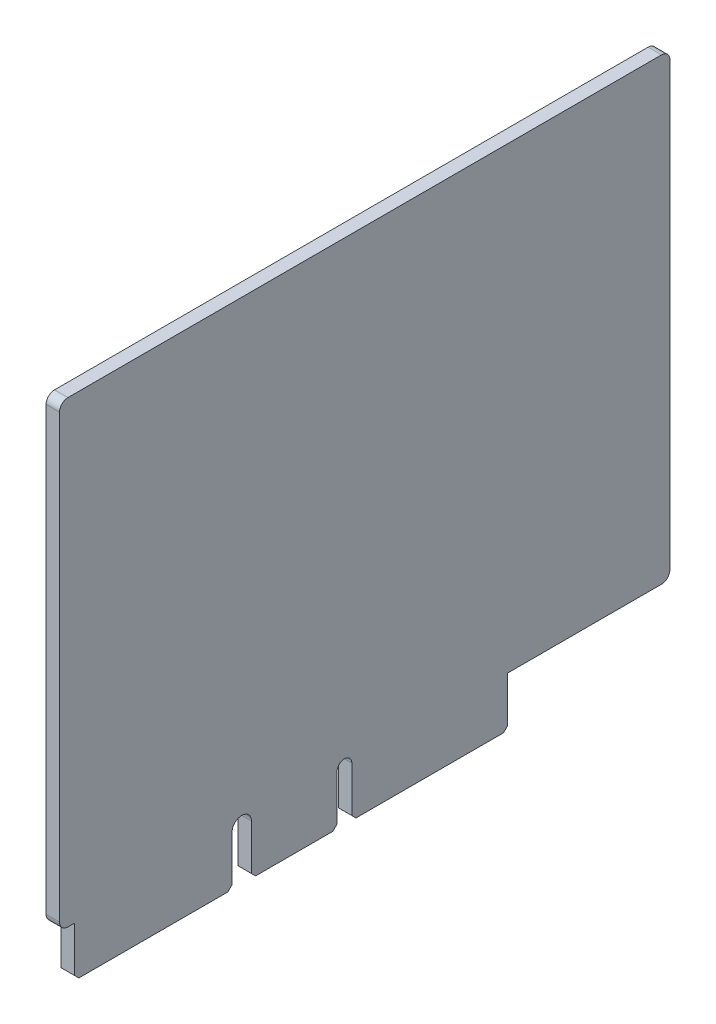
ISO-10303-21;
HEADER;
FILE_DESCRIPTION(('STEP AP214'),'2;1');
FILE_NAME('part.step','',(''),(''),'','','');
FILE_SCHEMA(('AUTOMOTIVE_DESIGN { 1 0 10303 214 1 1 1 1 }'));
ENDSEC;
DATA;
#1=APPLICATION_CONTEXT('core data for automotive mechanical design processes');
#2=APPLICATION_PROTOCOL_DEFINITION('international standard','automotive_design',2000,#1);
#3=PRODUCT_CONTEXT('',#1,'mechanical');
#4=PRODUCT('Part','Part','',(#3));
#5=PRODUCT_RELATED_PRODUCT_CATEGORY('part','',(#4));
#6=PRODUCT_DEFINITION_FORMATION('','',#4);
#7=PRODUCT_DEFINITION_CONTEXT('part definition',#1,'design');
#8=PRODUCT_DEFINITION('design','',#6,#7);
#9=PRODUCT_DEFINITION_SHAPE('','',#8);
#10=(LENGTH_UNIT() NAMED_UNIT(*) SI_UNIT(.MILLI.,.METRE.));
#11=(NAMED_UNIT(*) PLANE_ANGLE_UNIT() SI_UNIT($,.RADIAN.));
#12=(NAMED_UNIT(*) SI_UNIT($,.STERADIAN.) SOLID_ANGLE_UNIT());
#13=UNCERTAINTY_MEASURE_WITH_UNIT(LENGTH_MEASURE(1.E-05),#10,'distance_accuracy_value','');
#14=(GEOMETRIC_REPRESENTATION_CONTEXT(3) GLOBAL_UNCERTAINTY_ASSIGNED_CONTEXT((#13)) GLOBAL_UNIT_ASSIGNED_CONTEXT((#10,
#11,#12)) REPRESENTATION_CONTEXT('',''));
#15=CARTESIAN_POINT('',(0.,0.,0.));
#16=DIRECTION('',(0.,0.,1.));
#17=DIRECTION('',(1.,0.,0.));
#18=AXIS2_PLACEMENT_3D('',#15,#16,#17);
#19=CARTESIAN_POINT('',(23.0249346823607,112.017340514093,65.4077405682385));
#20=DIRECTION('',(0.,0.,1.));
#21=DIRECTION('',(1.,0.,0.));
#22=AXIS2_PLACEMENT_3D('',#19,#20,#21);
#23=PLANE('',#22);
#24=DIRECTION('',(0.,-1.,0.));
#25=VECTOR('',#24,1.);
#26=CARTESIAN_POINT('',(23.0249346823607,112.017340514093,65.4077405682385));
#27=LINE('',#26,#25);
#28=CARTESIAN_POINT('',(23.0249346823607,111.017340514093,65.4077405682385));
#29=VERTEX_POINT('',#28);
#30=CARTESIAN_POINT('',(23.0249346823607,58.2752309304151,65.4077405682385));
#31=VERTEX_POINT('',#30);
#32=EDGE_CURVE('E290',#29,#31,#27,.T.);
#33=ORIENTED_EDGE('',*,*,#32,.T.);
#34=DIRECTION('',(1.,0.,0.));
#35=VECTOR('',#34,1.);
#36=CARTESIAN_POINT('',(23.0249346823607,58.2752309304151,65.4077405682385));
#37=LINE('',#36,#35);
#38=CARTESIAN_POINT('',(24.6249346823607,58.2752309304151,65.4077405682385));
#39=VERTEX_POINT('',#38);
#40=EDGE_CURVE('E385',#31,#39,#37,.T.);
#41=ORIENTED_EDGE('',*,*,#40,.T.);
#42=DIRECTION('',(0.,-1.,0.));
#43=VECTOR('',#42,1.);
#44=CARTESIAN_POINT('',(24.6249346823607,112.017340514093,65.4077405682385));
#45=LINE('',#44,#43);
#46=CARTESIAN_POINT('',(24.6249346823607,111.017340514093,65.4077405682385));
#47=VERTEX_POINT('',#46);
#48=EDGE_CURVE('E217',#47,#39,#45,.T.);
#49=ORIENTED_EDGE('',*,*,#48,.F.);
#50=DIRECTION('',(1.,0.,0.));
#51=VECTOR('',#50,1.);
#52=CARTESIAN_POINT('',(23.0249346823607,111.017340514093,65.4077405682385));
#53=LINE('',#52,#51);
#54=EDGE_CURVE('E352',#47,#29,#53,.F.);
#55=ORIENTED_EDGE('',*,*,#54,.T.);
#56=EDGE_LOOP('',(#33,#41,#49,#55));
#57=FACE_BOUND('',#56,.T.);
#58=ADVANCED_FACE('F32',(#57),#23,.T.);
#59=CARTESIAN_POINT('',(23.0249346823607,112.017340514093,65.4077405682385));
#60=DIRECTION('',(0.,1.,0.));
#61=DIRECTION('',(0.,0.,1.));
#62=AXIS2_PLACEMENT_3D('',#59,#60,#61);
#63=PLANE('',#62);
#64=DIRECTION('',(0.,0.,1.));
#65=VECTOR('',#64,1.);
#66=CARTESIAN_POINT('',(24.6249346823607,112.017340514093,65.4077405682385));
#67=LINE('',#66,#65);
#68=CARTESIAN_POINT('',(24.6249346823607,112.017340514093,-6.47359798304545));
#69=VERTEX_POINT('',#68);
#70=CARTESIAN_POINT('',(24.6249346823607,112.017340514093,64.4077405682385));
#71=VERTEX_POINT('',#70);
#72=EDGE_CURVE('E287',#69,#71,#67,.T.);
#73=ORIENTED_EDGE('',*,*,#72,.F.);
#74=DIRECTION('',(1.,0.,0.));
#75=VECTOR('',#74,1.);
#76=CARTESIAN_POINT('',(23.0249346823607,112.017340514093,-6.47359798304545));
#77=LINE('',#76,#75);
#78=CARTESIAN_POINT('',(23.0249346823607,112.017340514093,-6.47359798304545));
#79=VERTEX_POINT('',#78);
#80=EDGE_CURVE('E11',#69,#79,#77,.F.);
#81=ORIENTED_EDGE('',*,*,#80,.T.);
#82=DIRECTION('',(0.,0.,1.));
#83=VECTOR('',#82,1.);
#84=CARTESIAN_POINT('',(23.0249346823607,112.017340514093,65.4077405682385));
#85=LINE('',#84,#83);
#86=CARTESIAN_POINT('',(23.0249346823607,112.017340514093,64.4077405682385));
#87=VERTEX_POINT('',#86);
#88=EDGE_CURVE('E228',#79,#87,#85,.T.);
#89=ORIENTED_EDGE('',*,*,#88,.T.);
#90=DIRECTION('',(1.,0.,0.));
#91=VECTOR('',#90,1.);
#92=CARTESIAN_POINT('',(23.0249346823607,112.017340514093,64.4077405682385));
#93=LINE('',#92,#91);
#94=EDGE_CURVE('E40',#87,#71,#93,.T.);
#95=ORIENTED_EDGE('',*,*,#94,.T.);
#96=EDGE_LOOP('',(#73,#81,#89,#95));
#97=FACE_BOUND('',#96,.T.);
#98=ADVANCED_FACE('F414',(#97),#63,.T.);
#99=CARTESIAN_POINT('',(23.0249346823607,112.017340514093,-7.47359798304545));
#100=DIRECTION('',(0.,0.,-1.));
#101=DIRECTION('',(-1.,0.,0.));
#102=AXIS2_PLACEMENT_3D('',#99,#100,#101);
#103=PLANE('',#102);
#104=DIRECTION('',(0.,1.,0.));
#105=VECTOR('',#104,1.);
#106=CARTESIAN_POINT('',(24.6249346823607,112.017340514093,-7.47359798304545));
#107=LINE('',#106,#105);
#108=CARTESIAN_POINT('',(24.6249346823607,58.2752309304151,-7.47359798304545));
#109=VERTEX_POINT('',#108);
#110=CARTESIAN_POINT('',(24.6249346823607,111.017340514093,-7.47359798304545));
#111=VERTEX_POINT('',#110);
#112=EDGE_CURVE('E284',#109,#111,#107,.T.);
#113=ORIENTED_EDGE('',*,*,#112,.F.);
#114=DIRECTION('',(1.,0.,0.));
#115=VECTOR('',#114,1.);
#116=CARTESIAN_POINT('',(23.0249346823607,58.2752309304151,-7.47359798304545));
#117=LINE('',#116,#115);
#118=CARTESIAN_POINT('',(23.0249346823607,58.2752309304151,-7.47359798304545));
#119=VERTEX_POINT('',#118);
#120=EDGE_CURVE('E409',#109,#119,#117,.F.);
#121=ORIENTED_EDGE('',*,*,#120,.T.);
#122=DIRECTION('',(0.,1.,0.));
#123=VECTOR('',#122,1.);
#124=CARTESIAN_POINT('',(23.0249346823607,112.017340514093,-7.47359798304545));
#125=LINE('',#124,#123);
#126=CARTESIAN_POINT('',(23.0249346823607,111.017340514093,-7.47359798304545));
#127=VERTEX_POINT('',#126);
#128=EDGE_CURVE('E346',#119,#127,#125,.T.);
#129=ORIENTED_EDGE('',*,*,#128,.T.);
#130=DIRECTION('',(1.,0.,0.));
#131=VECTOR('',#130,1.);
#132=CARTESIAN_POINT('',(23.0249346823607,111.017340514093,-7.47359798304545));
#133=LINE('',#132,#131);
#134=EDGE_CURVE('E406',#127,#111,#133,.T.);
#135=ORIENTED_EDGE('',*,*,#134,.T.);
#136=EDGE_LOOP('',(#113,#121,#129,#135));
#137=FACE_BOUND('',#136,.T.);
#138=ADVANCED_FACE('F424',(#137),#103,.T.);
#139=CARTESIAN_POINT('',(23.0249346823607,57.2752309304151,11.8877405682385));
#140=DIRECTION('',(0.,-1.,0.));
#141=DIRECTION('',(0.,0.,-1.));
#142=AXIS2_PLACEMENT_3D('',#139,#140,#141);
#143=PLANE('',#142);
#144=DIRECTION('',(0.,0.,-1.));
#145=VECTOR('',#144,1.);
#146=CARTESIAN_POINT('',(23.0249346823607,57.2752309304151,11.8877405682385));
#147=LINE('',#146,#145);
#148=CARTESIAN_POINT('',(23.0249346823607,57.2752309304151,11.8877405682385));
#149=VERTEX_POINT('',#148);
#150=CARTESIAN_POINT('',(23.0249346823607,57.2752309304151,-6.47359798304545));
#151=VERTEX_POINT('',#150);
#152=EDGE_CURVE('E344',#149,#151,#147,.T.);
#153=ORIENTED_EDGE('',*,*,#152,.T.);
#154=DIRECTION('',(1.,0.,0.));
#155=VECTOR('',#154,1.);
#156=CARTESIAN_POINT('',(23.0249346823607,57.2752309304151,-6.47359798304545));
#157=LINE('',#156,#155);
#158=CARTESIAN_POINT('',(24.6249346823607,57.2752309304151,-6.47359798304545));
#159=VERTEX_POINT('',#158);
#160=EDGE_CURVE('E403',#151,#159,#157,.T.);
#161=ORIENTED_EDGE('',*,*,#160,.T.);
#162=DIRECTION('',(0.,0.,-1.));
#163=VECTOR('',#162,1.);
#164=CARTESIAN_POINT('',(24.6249346823607,57.2752309304151,11.8877405682385));
#165=LINE('',#164,#163);
#166=CARTESIAN_POINT('',(24.6249346823607,57.2752309304151,11.8877405682385));
#167=VERTEX_POINT('',#166);
#168=EDGE_CURVE('E281',#167,#159,#165,.T.);
#169=ORIENTED_EDGE('',*,*,#168,.F.);
#170=DIRECTION('',(1.,0.,0.));
#171=VECTOR('',#170,1.);
#172=CARTESIAN_POINT('',(23.0249346823607,57.2752309304151,11.8877405682385));
#173=LINE('',#172,#171);
#174=EDGE_CURVE('E350',#149,#167,#173,.T.);
#175=ORIENTED_EDGE('',*,*,#174,.F.);
#176=EDGE_LOOP('',(#153,#161,#169,#175));
#177=FACE_BOUND('',#176,.T.);
#178=ADVANCED_FACE('F432',(#177),#143,.T.);
#179=CARTESIAN_POINT('',(23.0249346823607,51.8452309304141,11.8877405682385));
#180=DIRECTION('',(0.,0.,-1.));
#181=DIRECTION('',(-1.,0.,0.));
#182=AXIS2_PLACEMENT_3D('',#179,#180,#181);
#183=PLANE('',#182);
#184=ORIENTED_EDGE('',*,*,#174,.T.);
#185=DIRECTION('',(0.,1.,0.));
#186=VECTOR('',#185,1.);
#187=CARTESIAN_POINT('',(24.6249346823607,51.8452309304141,11.8877405682385));
#188=LINE('',#187,#186);
#189=CARTESIAN_POINT('',(24.6249346823607,51.8452309304141,11.8877405682385));
#190=VERTEX_POINT('',#189);
#191=EDGE_CURVE('E278',#190,#167,#188,.T.);
#192=ORIENTED_EDGE('',*,*,#191,.F.);
#193=DIRECTION('',(1.,0.,0.));
#194=VECTOR('',#193,1.);
#195=CARTESIAN_POINT('',(23.0249346823607,51.8452309304141,11.8877405682385));
#196=LINE('',#195,#194);
#197=CARTESIAN_POINT('',(23.0249346823607,51.8452309304141,11.8877405682385));
#198=VERTEX_POINT('',#197);
#199=EDGE_CURVE('E353',#198,#190,#196,.T.);
#200=ORIENTED_EDGE('',*,*,#199,.F.);
#201=DIRECTION('',(0.,1.,0.));
#202=VECTOR('',#201,1.);
#203=CARTESIAN_POINT('',(23.0249346823607,51.8452309304141,11.8877405682385));
#204=LINE('',#203,#202);
#205=EDGE_CURVE('E341',#198,#149,#204,.T.);
#206=ORIENTED_EDGE('',*,*,#205,.T.);
#207=EDGE_LOOP('',(#184,#192,#200,#206));
#208=FACE_BOUND('',#207,.T.);
#209=ADVANCED_FACE('F436',(#208),#183,.T.);
#210=CARTESIAN_POINT('',(23.0249346823607,51.3452309304141,12.3877405682385));
#211=DIRECTION('',(0.,-0.707106781186548,-0.707106781186548));
#212=DIRECTION('',(0.,0.707106781186548,-0.707106781186548));
#213=AXIS2_PLACEMENT_3D('',#210,#211,#212);
#214=PLANE('',#213);
#215=ORIENTED_EDGE('',*,*,#199,.T.);
#216=DIRECTION('',(0.,0.707106781186547,-0.707106781186547));
#217=VECTOR('',#216,1.);
#218=CARTESIAN_POINT('',(24.6249346823607,51.3452309304141,12.3877405682385));
#219=LINE('',#218,#217);
#220=CARTESIAN_POINT('',(24.6249346823607,51.3452309304141,12.3877405682385));
#221=VERTEX_POINT('',#220);
#222=EDGE_CURVE('E275',#221,#190,#219,.T.);
#223=ORIENTED_EDGE('',*,*,#222,.F.);
#224=DIRECTION('',(1.,0.,0.));
#225=VECTOR('',#224,1.);
#226=CARTESIAN_POINT('',(23.0249346823607,51.3452309304141,12.3877405682385));
#227=LINE('',#226,#225);
#228=CARTESIAN_POINT('',(23.0249346823607,51.3452309304141,12.3877405682385));
#229=VERTEX_POINT('',#228);
#230=EDGE_CURVE('E355',#229,#221,#227,.T.);
#231=ORIENTED_EDGE('',*,*,#230,.F.);
#232=DIRECTION('',(0.,0.707106781186547,-0.707106781186547));
#233=VECTOR('',#232,1.);
#234=CARTESIAN_POINT('',(23.0249346823607,51.3452309304141,12.3877405682385));
#235=LINE('',#234,#233);
#236=EDGE_CURVE('E338',#229,#198,#235,.T.);
#237=ORIENTED_EDGE('',*,*,#236,.T.);
#238=EDGE_LOOP('',(#215,#223,#231,#237));
#239=FACE_BOUND('',#238,.T.);
#240=ADVANCED_FACE('F441',(#239),#214,.T.);
#241=CARTESIAN_POINT('',(23.0249346823607,51.3452309304141,30.0077405682385));
#242=DIRECTION('',(0.,-1.,0.));
#243=DIRECTION('',(0.,0.,-1.));
#244=AXIS2_PLACEMENT_3D('',#241,#242,#243);
#245=PLANE('',#244);
#246=ORIENTED_EDGE('',*,*,#230,.T.);
#247=DIRECTION('',(0.,0.,-1.));
#248=VECTOR('',#247,1.);
#249=CARTESIAN_POINT('',(24.6249346823607,51.3452309304141,30.0077405682385));
#250=LINE('',#249,#248);
#251=CARTESIAN_POINT('',(24.6249346823607,51.3452309304141,30.0077405682385));
#252=VERTEX_POINT('',#251);
#253=EDGE_CURVE('E272',#252,#221,#250,.T.);
#254=ORIENTED_EDGE('',*,*,#253,.F.);
#255=DIRECTION('',(1.,0.,0.));
#256=VECTOR('',#255,1.);
#257=CARTESIAN_POINT('',(23.0249346823607,51.3452309304141,30.0077405682385));
#258=LINE('',#257,#256);
#259=CARTESIAN_POINT('',(23.0249346823607,51.3452309304141,30.0077405682385));
#260=VERTEX_POINT('',#259);
#261=EDGE_CURVE('E357',#260,#252,#258,.T.);
#262=ORIENTED_EDGE('',*,*,#261,.F.);
#263=DIRECTION('',(0.,0.,-1.));
#264=VECTOR('',#263,1.);
#265=CARTESIAN_POINT('',(23.0249346823607,51.3452309304141,30.0077405682385));
#266=LINE('',#265,#264);
#267=EDGE_CURVE('E335',#260,#229,#266,.T.);
#268=ORIENTED_EDGE('',*,*,#267,.T.);
#269=EDGE_LOOP('',(#246,#254,#262,#268));
#270=FACE_BOUND('',#269,.T.);
#271=ADVANCED_FACE('F444',(#270),#245,.T.);
#272=CARTESIAN_POINT('',(23.0249346823607,51.8452309304141,30.5077405682385));
#273=DIRECTION('',(0.,-0.707106781186548,0.707106781186548));
#274=DIRECTION('',(0.,-0.707106781186548,-0.707106781186548));
#275=AXIS2_PLACEMENT_3D('',#272,#273,#274);
#276=PLANE('',#275);
#277=ORIENTED_EDGE('',*,*,#261,.T.);
#278=DIRECTION('',(0.,-0.707106781186547,-0.707106781186547));
#279=VECTOR('',#278,1.);
#280=CARTESIAN_POINT('',(24.6249346823607,51.8452309304141,30.5077405682385));
#281=LINE('',#280,#279);
#282=CARTESIAN_POINT('',(24.6249346823607,51.8452309304141,30.5077405682385));
#283=VERTEX_POINT('',#282);
#284=EDGE_CURVE('E269',#283,#252,#281,.T.);
#285=ORIENTED_EDGE('',*,*,#284,.F.);
#286=DIRECTION('',(1.,0.,0.));
#287=VECTOR('',#286,1.);
#288=CARTESIAN_POINT('',(23.0249346823607,51.8452309304141,30.5077405682385));
#289=LINE('',#288,#287);
#290=CARTESIAN_POINT('',(23.0249346823607,51.8452309304141,30.5077405682385));
#291=VERTEX_POINT('',#290);
#292=EDGE_CURVE('E359',#291,#283,#289,.T.);
#293=ORIENTED_EDGE('',*,*,#292,.F.);
#294=DIRECTION('',(0.,-0.707106781186547,-0.707106781186547));
#295=VECTOR('',#294,1.);
#296=CARTESIAN_POINT('',(23.0249346823607,51.8452309304141,30.5077405682385));
#297=LINE('',#296,#295);
#298=EDGE_CURVE('E332',#291,#260,#297,.T.);
#299=ORIENTED_EDGE('',*,*,#298,.T.);
#300=EDGE_LOOP('',(#277,#285,#293,#299));
#301=FACE_BOUND('',#300,.T.);
#302=ADVANCED_FACE('F448',(#301),#276,.T.);
#303=CARTESIAN_POINT('',(23.0249346823607,57.2752309304151,30.5077405682385));
#304=DIRECTION('',(0.,0.,1.));
#305=DIRECTION('',(1.,0.,0.));
#306=AXIS2_PLACEMENT_3D('',#303,#304,#305);
#307=PLANE('',#306);
#308=ORIENTED_EDGE('',*,*,#292,.T.);
#309=DIRECTION('',(0.,-1.,0.));
#310=VECTOR('',#309,1.);
#311=CARTESIAN_POINT('',(24.6249346823607,57.2752309304151,30.5077405682385));
#312=LINE('',#311,#310);
#313=CARTESIAN_POINT('',(24.6249346823607,57.2752309304151,30.5077405682385));
#314=VERTEX_POINT('',#313);
#315=EDGE_CURVE('E266',#314,#283,#312,.T.);
#316=ORIENTED_EDGE('',*,*,#315,.F.);
#317=DIRECTION('',(1.,0.,0.));
#318=VECTOR('',#317,1.);
#319=CARTESIAN_POINT('',(23.0249346823607,57.2752309304151,30.5077405682385));
#320=LINE('',#319,#318);
#321=CARTESIAN_POINT('',(23.0249346823607,57.2752309304151,30.5077405682385));
#322=VERTEX_POINT('',#321);
#323=EDGE_CURVE('E361',#322,#314,#320,.T.);
#324=ORIENTED_EDGE('',*,*,#323,.F.);
#325=DIRECTION('',(0.,-1.,0.));
#326=VECTOR('',#325,1.);
#327=CARTESIAN_POINT('',(23.0249346823607,57.2752309304151,30.5077405682385));
#328=LINE('',#327,#326);
#329=EDGE_CURVE('E329',#322,#291,#328,.T.);
#330=ORIENTED_EDGE('',*,*,#329,.T.);
#331=EDGE_LOOP('',(#308,#316,#324,#330));
#332=FACE_BOUND('',#331,.T.);
#333=ADVANCED_FACE('F453',(#332),#307,.T.);
#334=CARTESIAN_POINT('',(23.0249346823607,57.2752309304151,31.3877405682386));
#335=DIRECTION('',(1.,0.,0.));
#336=DIRECTION('',(0.,0.,-1.));
#337=AXIS2_PLACEMENT_3D('',#334,#335,#336);
#338=CYLINDRICAL_SURFACE('',#337,0.880000000000002);
#339=ORIENTED_EDGE('',*,*,#323,.T.);
#340=CARTESIAN_POINT('',(24.6249346823607,57.2752309304151,31.3877405682386));
#341=DIRECTION('',(-1.,0.,0.));
#342=DIRECTION('',(0.,0.,-1.));
#343=AXIS2_PLACEMENT_3D('',#340,#341,#342);
#344=CIRCLE('',#343,0.880000000000002);
#345=CARTESIAN_POINT('',(24.6249346823607,57.2752309304151,32.2677405682386));
#346=VERTEX_POINT('',#345);
#347=EDGE_CURVE('E263',#346,#314,#344,.T.);
#348=ORIENTED_EDGE('',*,*,#347,.F.);
#349=DIRECTION('',(1.,0.,0.));
#350=VECTOR('',#349,1.);
#351=CARTESIAN_POINT('',(23.0249346823607,57.2752309304151,32.2677405682386));
#352=LINE('',#351,#350);
#353=CARTESIAN_POINT('',(23.0249346823607,57.2752309304151,32.2677405682386));
#354=VERTEX_POINT('',#353);
#355=EDGE_CURVE('E363',#354,#346,#352,.T.);
#356=ORIENTED_EDGE('',*,*,#355,.F.);
#357=CARTESIAN_POINT('',(23.0249346823607,57.2752309304151,31.3877405682386));
#358=DIRECTION('',(-1.,0.,0.));
#359=DIRECTION('',(0.,0.,-1.));
#360=AXIS2_PLACEMENT_3D('',#357,#358,#359);
#361=CIRCLE('',#360,0.880000000000002);
#362=EDGE_CURVE('E326',#354,#322,#361,.T.);
#363=ORIENTED_EDGE('',*,*,#362,.T.);
#364=EDGE_LOOP('',(#339,#348,#356,#363));
#365=FACE_BOUND('',#364,.T.);
#366=ADVANCED_FACE('F456',(#365),#338,.F.);
#367=CARTESIAN_POINT('',(23.0249346823607,51.8452309304141,32.2677405682386));
#368=DIRECTION('',(0.,0.,-1.));
#369=DIRECTION('',(-1.,0.,0.));
#370=AXIS2_PLACEMENT_3D('',#367,#368,#369);
#371=PLANE('',#370);
#372=ORIENTED_EDGE('',*,*,#355,.T.);
#373=DIRECTION('',(0.,1.,0.));
#374=VECTOR('',#373,1.);
#375=CARTESIAN_POINT('',(24.6249346823607,51.8452309304141,32.2677405682386));
#376=LINE('',#375,#374);
#377=CARTESIAN_POINT('',(24.6249346823607,51.8452309304141,32.2677405682386));
#378=VERTEX_POINT('',#377);
#379=EDGE_CURVE('E260',#378,#346,#376,.T.);
#380=ORIENTED_EDGE('',*,*,#379,.F.);
#381=DIRECTION('',(1.,0.,0.));
#382=VECTOR('',#381,1.);
#383=CARTESIAN_POINT('',(23.0249346823607,51.8452309304141,32.2677405682386));
#384=LINE('',#383,#382);
#385=CARTESIAN_POINT('',(23.0249346823607,51.8452309304141,32.2677405682386));
#386=VERTEX_POINT('',#385);
#387=EDGE_CURVE('E365',#386,#378,#384,.T.);
#388=ORIENTED_EDGE('',*,*,#387,.F.);
#389=DIRECTION('',(0.,1.,0.));
#390=VECTOR('',#389,1.);
#391=CARTESIAN_POINT('',(23.0249346823607,51.8452309304141,32.2677405682386));
#392=LINE('',#391,#390);
#393=EDGE_CURVE('E323',#386,#354,#392,.T.);
#394=ORIENTED_EDGE('',*,*,#393,.T.);
#395=EDGE_LOOP('',(#372,#380,#388,#394));
#396=FACE_BOUND('',#395,.T.);
#397=ADVANCED_FACE('F460',(#396),#371,.T.);
#398=CARTESIAN_POINT('',(23.0249346823607,51.3452309304141,32.7677405682386));
#399=DIRECTION('',(0.,-0.707106781186548,-0.707106781186548));
#400=DIRECTION('',(0.,0.707106781186548,-0.707106781186548));
#401=AXIS2_PLACEMENT_3D('',#398,#399,#400);
#402=PLANE('',#401);
#403=ORIENTED_EDGE('',*,*,#387,.T.);
#404=DIRECTION('',(0.,0.707106781186547,-0.707106781186547));
#405=VECTOR('',#404,1.);
#406=CARTESIAN_POINT('',(24.6249346823607,51.3452309304141,32.7677405682386));
#407=LINE('',#406,#405);
#408=CARTESIAN_POINT('',(24.6249346823607,51.3452309304141,32.7677405682386));
#409=VERTEX_POINT('',#408);
#410=EDGE_CURVE('E257',#409,#378,#407,.T.);
#411=ORIENTED_EDGE('',*,*,#410,.F.);
#412=DIRECTION('',(1.,0.,0.));
#413=VECTOR('',#412,1.);
#414=CARTESIAN_POINT('',(23.0249346823607,51.3452309304141,32.7677405682386));
#415=LINE('',#414,#413);
#416=CARTESIAN_POINT('',(23.0249346823607,51.3452309304141,32.7677405682386));
#417=VERTEX_POINT('',#416);
#418=EDGE_CURVE('E367',#417,#409,#415,.T.);
#419=ORIENTED_EDGE('',*,*,#418,.F.);
#420=DIRECTION('',(0.,0.707106781186547,-0.707106781186547));
#421=VECTOR('',#420,1.);
#422=CARTESIAN_POINT('',(23.0249346823607,51.3452309304141,32.7677405682386));
#423=LINE('',#422,#421);
#424=EDGE_CURVE('E320',#417,#386,#423,.T.);
#425=ORIENTED_EDGE('',*,*,#424,.T.);
#426=EDGE_LOOP('',(#403,#411,#419,#425));
#427=FACE_BOUND('',#426,.T.);
#428=ADVANCED_FACE('F465',(#427),#402,.T.);
#429=CARTESIAN_POINT('',(23.0249346823607,51.3452309304141,41.9927405682385));
#430=DIRECTION('',(0.,-1.,0.));
#431=DIRECTION('',(0.,0.,-1.));
#432=AXIS2_PLACEMENT_3D('',#429,#430,#431);
#433=PLANE('',#432);
#434=ORIENTED_EDGE('',*,*,#418,.T.);
#435=DIRECTION('',(0.,0.,-1.));
#436=VECTOR('',#435,1.);
#437=CARTESIAN_POINT('',(24.6249346823607,51.3452309304141,41.9927405682385));
#438=LINE('',#437,#436);
#439=CARTESIAN_POINT('',(24.6249346823607,51.3452309304141,41.9927405682385));
#440=VERTEX_POINT('',#439);
#441=EDGE_CURVE('E254',#440,#409,#438,.T.);
#442=ORIENTED_EDGE('',*,*,#441,.F.);
#443=DIRECTION('',(1.,0.,0.));
#444=VECTOR('',#443,1.);
#445=CARTESIAN_POINT('',(23.0249346823607,51.3452309304141,41.9927405682385));
#446=LINE('',#445,#444);
#447=CARTESIAN_POINT('',(23.0249346823607,51.3452309304141,41.9927405682385));
#448=VERTEX_POINT('',#447);
#449=EDGE_CURVE('E369',#448,#440,#446,.T.);
#450=ORIENTED_EDGE('',*,*,#449,.F.);
#451=DIRECTION('',(0.,0.,-1.));
#452=VECTOR('',#451,1.);
#453=CARTESIAN_POINT('',(23.0249346823607,51.3452309304141,41.9927405682385));
#454=LINE('',#453,#452);
#455=EDGE_CURVE('E317',#448,#417,#454,.T.);
#456=ORIENTED_EDGE('',*,*,#455,.T.);
#457=EDGE_LOOP('',(#434,#442,#450,#456));
#458=FACE_BOUND('',#457,.T.);
#459=ADVANCED_FACE('F468',(#458),#433,.T.);
#460=CARTESIAN_POINT('',(23.0249346823607,51.8452309304141,42.4927405682385));
#461=DIRECTION('',(0.,-0.707106781186548,0.707106781186548));
#462=DIRECTION('',(0.,-0.707106781186548,-0.707106781186548));
#463=AXIS2_PLACEMENT_3D('',#460,#461,#462);
#464=PLANE('',#463);
#465=ORIENTED_EDGE('',*,*,#449,.T.);
#466=DIRECTION('',(0.,-0.707106781186547,-0.707106781186547));
#467=VECTOR('',#466,1.);
#468=CARTESIAN_POINT('',(24.6249346823607,51.8452309304141,42.4927405682385));
#469=LINE('',#468,#467);
#470=CARTESIAN_POINT('',(24.6249346823607,51.8452309304141,42.4927405682385));
#471=VERTEX_POINT('',#470);
#472=EDGE_CURVE('E251',#471,#440,#469,.T.);
#473=ORIENTED_EDGE('',*,*,#472,.F.);
#474=DIRECTION('',(1.,0.,0.));
#475=VECTOR('',#474,1.);
#476=CARTESIAN_POINT('',(23.0249346823607,51.8452309304141,42.4927405682385));
#477=LINE('',#476,#475);
#478=CARTESIAN_POINT('',(23.0249346823607,51.8452309304141,42.4927405682385));
#479=VERTEX_POINT('',#478);
#480=EDGE_CURVE('E371',#479,#471,#477,.T.);
#481=ORIENTED_EDGE('',*,*,#480,.F.);
#482=DIRECTION('',(0.,-0.707106781186547,-0.707106781186547));
#483=VECTOR('',#482,1.);
#484=CARTESIAN_POINT('',(23.0249346823607,51.8452309304141,42.4927405682385));
#485=LINE('',#484,#483);
#486=EDGE_CURVE('E314',#479,#448,#485,.T.);
#487=ORIENTED_EDGE('',*,*,#486,.T.);
#488=EDGE_LOOP('',(#465,#473,#481,#487));
#489=FACE_BOUND('',#488,.T.);
#490=ADVANCED_FACE('F472',(#489),#464,.T.);
#491=CARTESIAN_POINT('',(23.0249346823607,57.2752309304151,42.4927405682385));
#492=DIRECTION('',(0.,0.,1.));
#493=DIRECTION('',(1.,0.,0.));
#494=AXIS2_PLACEMENT_3D('',#491,#492,#493);
#495=PLANE('',#494);
#496=ORIENTED_EDGE('',*,*,#480,.T.);
#497=DIRECTION('',(0.,-1.,0.));
#498=VECTOR('',#497,1.);
#499=CARTESIAN_POINT('',(24.6249346823607,57.2752309304151,42.4927405682385));
#500=LINE('',#499,#498);
#501=CARTESIAN_POINT('',(24.6249346823607,57.2752309304151,42.4927405682385));
#502=VERTEX_POINT('',#501);
#503=EDGE_CURVE('E248',#502,#471,#500,.T.);
#504=ORIENTED_EDGE('',*,*,#503,.F.);
#505=DIRECTION('',(1.,0.,0.));
#506=VECTOR('',#505,1.);
#507=CARTESIAN_POINT('',(23.0249346823607,57.2752309304151,42.4927405682385));
#508=LINE('',#507,#506);
#509=CARTESIAN_POINT('',(23.0249346823607,57.2752309304151,42.4927405682385));
#510=VERTEX_POINT('',#509);
#511=EDGE_CURVE('E373',#510,#502,#508,.T.);
#512=ORIENTED_EDGE('',*,*,#511,.F.);
#513=DIRECTION('',(0.,-1.,0.));
#514=VECTOR('',#513,1.);
#515=CARTESIAN_POINT('',(23.0249346823607,57.2752309304151,42.4927405682385));
#516=LINE('',#515,#514);
#517=EDGE_CURVE('E311',#510,#479,#516,.T.);
#518=ORIENTED_EDGE('',*,*,#517,.T.);
#519=EDGE_LOOP('',(#496,#504,#512,#518));
#520=FACE_BOUND('',#519,.T.);
#521=ADVANCED_FACE('F477',(#520),#495,.T.);
#522=CARTESIAN_POINT('',(23.0249346823607,57.2752309304151,43.6477405682385));
#523=DIRECTION('',(1.,0.,0.));
#524=DIRECTION('',(0.,0.,-1.));
#525=AXIS2_PLACEMENT_3D('',#522,#523,#524);
#526=CYLINDRICAL_SURFACE('',#525,1.155);
#527=ORIENTED_EDGE('',*,*,#511,.T.);
#528=CARTESIAN_POINT('',(24.6249346823607,57.2752309304151,43.6477405682385));
#529=DIRECTION('',(-1.,0.,0.));
#530=DIRECTION('',(0.,0.,-1.));
#531=AXIS2_PLACEMENT_3D('',#528,#529,#530);
#532=CIRCLE('',#531,1.155);
#533=CARTESIAN_POINT('',(24.6249346823607,57.2752309304151,44.8027405682385));
#534=VERTEX_POINT('',#533);
#535=EDGE_CURVE('E245',#534,#502,#532,.T.);
#536=ORIENTED_EDGE('',*,*,#535,.F.);
#537=DIRECTION('',(1.,0.,0.));
#538=VECTOR('',#537,1.);
#539=CARTESIAN_POINT('',(23.0249346823607,57.2752309304151,44.8027405682385));
#540=LINE('',#539,#538);
#541=CARTESIAN_POINT('',(23.0249346823607,57.2752309304151,44.8027405682385));
#542=VERTEX_POINT('',#541);
#543=EDGE_CURVE('E375',#542,#534,#540,.T.);
#544=ORIENTED_EDGE('',*,*,#543,.F.);
#545=CARTESIAN_POINT('',(23.0249346823607,57.2752309304151,43.6477405682385));
#546=DIRECTION('',(-1.,0.,0.));
#547=DIRECTION('',(0.,0.,-1.));
#548=AXIS2_PLACEMENT_3D('',#545,#546,#547);
#549=CIRCLE('',#548,1.155);
#550=EDGE_CURVE('E308',#542,#510,#549,.T.);
#551=ORIENTED_EDGE('',*,*,#550,.T.);
#552=EDGE_LOOP('',(#527,#536,#544,#551));
#553=FACE_BOUND('',#552,.T.);
#554=ADVANCED_FACE('F480',(#553),#526,.F.);
#555=CARTESIAN_POINT('',(23.0249346823607,51.8452309304141,44.8027405682385));
#556=DIRECTION('',(0.,0.,-1.));
#557=DIRECTION('',(-1.,0.,0.));
#558=AXIS2_PLACEMENT_3D('',#555,#556,#557);
#559=PLANE('',#558);
#560=ORIENTED_EDGE('',*,*,#543,.T.);
#561=DIRECTION('',(0.,1.,0.));
#562=VECTOR('',#561,1.);
#563=CARTESIAN_POINT('',(24.6249346823607,51.8452309304141,44.8027405682385));
#564=LINE('',#563,#562);
#565=CARTESIAN_POINT('',(24.6249346823607,51.8452309304141,44.8027405682385));
#566=VERTEX_POINT('',#565);
#567=EDGE_CURVE('E242',#566,#534,#564,.T.);
#568=ORIENTED_EDGE('',*,*,#567,.F.);
#569=DIRECTION('',(1.,0.,0.));
#570=VECTOR('',#569,1.);
#571=CARTESIAN_POINT('',(23.0249346823607,51.8452309304141,44.8027405682385));
#572=LINE('',#571,#570);
#573=CARTESIAN_POINT('',(23.0249346823607,51.8452309304141,44.8027405682385));
#574=VERTEX_POINT('',#573);
#575=EDGE_CURVE('E377',#574,#566,#572,.T.);
#576=ORIENTED_EDGE('',*,*,#575,.F.);
#577=DIRECTION('',(0.,1.,0.));
#578=VECTOR('',#577,1.);
#579=CARTESIAN_POINT('',(23.0249346823607,51.8452309304141,44.8027405682385));
#580=LINE('',#579,#578);
#581=EDGE_CURVE('E305',#574,#542,#580,.T.);
#582=ORIENTED_EDGE('',*,*,#581,.T.);
#583=EDGE_LOOP('',(#560,#568,#576,#582));
#584=FACE_BOUND('',#583,.T.);
#585=ADVANCED_FACE('F484',(#584),#559,.T.);
#586=CARTESIAN_POINT('',(23.0249346823607,51.3452309304141,45.3027405682385));
#587=DIRECTION('',(0.,-0.707106781186548,-0.707106781186548));
#588=DIRECTION('',(0.,0.707106781186548,-0.707106781186548));
#589=AXIS2_PLACEMENT_3D('',#586,#587,#588);
#590=PLANE('',#589);
#591=ORIENTED_EDGE('',*,*,#575,.T.);
#592=DIRECTION('',(0.,0.707106781186547,-0.707106781186547));
#593=VECTOR('',#592,1.);
#594=CARTESIAN_POINT('',(24.6249346823607,51.3452309304141,45.3027405682385));
#595=LINE('',#594,#593);
#596=CARTESIAN_POINT('',(24.6249346823607,51.3452309304141,45.3027405682385));
#597=VERTEX_POINT('',#596);
#598=EDGE_CURVE('E239',#597,#566,#595,.T.);
#599=ORIENTED_EDGE('',*,*,#598,.F.);
#600=DIRECTION('',(1.,0.,0.));
#601=VECTOR('',#600,1.);
#602=CARTESIAN_POINT('',(23.0249346823607,51.3452309304141,45.3027405682385));
#603=LINE('',#602,#601);
#604=CARTESIAN_POINT('',(23.0249346823607,51.3452309304141,45.3027405682385));
#605=VERTEX_POINT('',#604);
#606=EDGE_CURVE('E379',#605,#597,#603,.T.);
#607=ORIENTED_EDGE('',*,*,#606,.F.);
#608=DIRECTION('',(0.,0.707106781186547,-0.707106781186547));
#609=VECTOR('',#608,1.);
#610=CARTESIAN_POINT('',(23.0249346823607,51.3452309304141,45.3027405682385));
#611=LINE('',#610,#609);
#612=EDGE_CURVE('E302',#605,#574,#611,.T.);
#613=ORIENTED_EDGE('',*,*,#612,.T.);
#614=EDGE_LOOP('',(#591,#599,#607,#613));
#615=FACE_BOUND('',#614,.T.);
#616=ADVANCED_FACE('F489',(#615),#590,.T.);
#617=CARTESIAN_POINT('',(23.0249346823607,51.3452309304141,63.1027405682385));
#618=DIRECTION('',(0.,-1.,0.));
#619=DIRECTION('',(0.,0.,-1.));
#620=AXIS2_PLACEMENT_3D('',#617,#618,#619);
#621=PLANE('',#620);
#622=ORIENTED_EDGE('',*,*,#606,.T.);
#623=DIRECTION('',(0.,0.,-1.));
#624=VECTOR('',#623,1.);
#625=CARTESIAN_POINT('',(24.6249346823607,51.3452309304141,63.1027405682385));
#626=LINE('',#625,#624);
#627=CARTESIAN_POINT('',(24.6249346823607,51.3452309304141,63.1027405682385));
#628=VERTEX_POINT('',#627);
#629=EDGE_CURVE('E233',#628,#597,#626,.T.);
#630=ORIENTED_EDGE('',*,*,#629,.F.);
#631=DIRECTION('',(1.,0.,0.));
#632=VECTOR('',#631,1.);
#633=CARTESIAN_POINT('',(23.0249346823607,51.3452309304141,63.1027405682385));
#634=LINE('',#633,#632);
#635=CARTESIAN_POINT('',(23.0249346823607,51.3452309304141,63.1027405682385));
#636=VERTEX_POINT('',#635);
#637=EDGE_CURVE('E381',#636,#628,#634,.T.);
#638=ORIENTED_EDGE('',*,*,#637,.F.);
#639=DIRECTION('',(0.,0.,-1.));
#640=VECTOR('',#639,1.);
#641=CARTESIAN_POINT('',(23.0249346823607,51.3452309304141,63.1027405682385));
#642=LINE('',#641,#640);
#643=EDGE_CURVE('E299',#636,#605,#642,.T.);
#644=ORIENTED_EDGE('',*,*,#643,.T.);
#645=EDGE_LOOP('',(#622,#630,#638,#644));
#646=FACE_BOUND('',#645,.T.);
#647=ADVANCED_FACE('F492',(#646),#621,.T.);
#648=CARTESIAN_POINT('',(23.0249346823607,51.8452309304141,63.6027405682386));
#649=DIRECTION('',(0.,-0.707106781186567,0.707106781186528));
#650=DIRECTION('',(0.,-0.707106781186528,-0.707106781186567));
#651=AXIS2_PLACEMENT_3D('',#648,#649,#650);
#652=PLANE('',#651);
#653=ORIENTED_EDGE('',*,*,#637,.T.);
#654=DIRECTION('',(0.,-0.707106781186528,-0.707106781186567));
#655=VECTOR('',#654,1.);
#656=CARTESIAN_POINT('',(24.6249346823607,51.8452309304141,63.6027405682386));
#657=LINE('',#656,#655);
#658=CARTESIAN_POINT('',(24.6249346823607,51.8452309304141,63.6027405682386));
#659=VERTEX_POINT('',#658);
#660=EDGE_CURVE('E231',#659,#628,#657,.T.);
#661=ORIENTED_EDGE('',*,*,#660,.F.);
#662=DIRECTION('',(1.,0.,0.));
#663=VECTOR('',#662,1.);
#664=CARTESIAN_POINT('',(23.0249346823607,51.8452309304141,63.6027405682386));
#665=LINE('',#664,#663);
#666=CARTESIAN_POINT('',(23.0249346823607,51.8452309304141,63.6027405682386));
#667=VERTEX_POINT('',#666);
#668=EDGE_CURVE('E227',#667,#659,#665,.T.);
#669=ORIENTED_EDGE('',*,*,#668,.F.);
#670=DIRECTION('',(0.,-0.707106781186528,-0.707106781186567));
#671=VECTOR('',#670,1.);
#672=CARTESIAN_POINT('',(23.0249346823607,51.8452309304141,63.6027405682386));
#673=LINE('',#672,#671);
#674=EDGE_CURVE('E296',#667,#636,#673,.T.);
#675=ORIENTED_EDGE('',*,*,#674,.T.);
#676=EDGE_LOOP('',(#653,#661,#669,#675));
#677=FACE_BOUND('',#676,.T.);
#678=ADVANCED_FACE('F494',(#677),#652,.T.);
#679=CARTESIAN_POINT('',(23.0249346823607,57.2752309304151,63.6027405682385));
#680=DIRECTION('',(0.,0.,1.));
#681=DIRECTION('',(0.,-1.,0.));
#682=AXIS2_PLACEMENT_3D('',#679,#680,#681);
#683=PLANE('',#682);
#684=ORIENTED_EDGE('',*,*,#668,.T.);
#685=DIRECTION('',(0.,-1.,0.));
#686=VECTOR('',#685,1.);
#687=CARTESIAN_POINT('',(24.6249346823607,57.2752309304151,63.6027405682385));
#688=LINE('',#687,#686);
#689=CARTESIAN_POINT('',(24.6249346823607,57.2752309304151,63.6027405682385));
#690=VERTEX_POINT('',#689);
#691=EDGE_CURVE('E212',#690,#659,#688,.T.);
#692=ORIENTED_EDGE('',*,*,#691,.F.);
#693=DIRECTION('',(1.,0.,0.));
#694=VECTOR('',#693,1.);
#695=CARTESIAN_POINT('',(23.0249346823607,57.2752309304151,63.6027405682385));
#696=LINE('',#695,#694);
#697=CARTESIAN_POINT('',(23.0249346823607,57.2752309304151,63.6027405682385));
#698=VERTEX_POINT('',#697);
#699=EDGE_CURVE('E220',#698,#690,#696,.T.);
#700=ORIENTED_EDGE('',*,*,#699,.F.);
#701=DIRECTION('',(0.,-1.,0.));
#702=VECTOR('',#701,1.);
#703=CARTESIAN_POINT('',(23.0249346823607,57.2752309304151,63.6027405682385));
#704=LINE('',#703,#702);
#705=EDGE_CURVE('E294',#698,#667,#704,.T.);
#706=ORIENTED_EDGE('',*,*,#705,.T.);
#707=EDGE_LOOP('',(#684,#692,#700,#706));
#708=FACE_BOUND('',#707,.T.);
#709=ADVANCED_FACE('F230',(#708),#683,.T.);
#710=CARTESIAN_POINT('',(23.0249346823607,57.2752309304151,65.4077405682385));
#711=DIRECTION('',(0.,-1.,0.));
#712=DIRECTION('',(0.,0.,-1.));
#713=AXIS2_PLACEMENT_3D('',#710,#711,#712);
#714=PLANE('',#713);
#715=DIRECTION('',(0.,0.,-1.));
#716=VECTOR('',#715,1.);
#717=CARTESIAN_POINT('',(24.6249346823607,57.2752309304151,65.4077405682385));
#718=LINE('',#717,#716);
#719=CARTESIAN_POINT('',(24.6249346823607,57.2752309304151,64.4077405682385));
#720=VERTEX_POINT('',#719);
#721=EDGE_CURVE('E206',#720,#690,#718,.T.);
#722=ORIENTED_EDGE('',*,*,#721,.F.);
#723=DIRECTION('',(1.,0.,0.));
#724=VECTOR('',#723,1.);
#725=CARTESIAN_POINT('',(23.0249346823607,57.2752309304151,64.4077405682385));
#726=LINE('',#725,#724);
#727=CARTESIAN_POINT('',(23.0249346823607,57.2752309304151,64.4077405682385));
#728=VERTEX_POINT('',#727);
#729=EDGE_CURVE('E395',#720,#728,#726,.F.);
#730=ORIENTED_EDGE('',*,*,#729,.T.);
#731=DIRECTION('',(0.,0.,-1.));
#732=VECTOR('',#731,1.);
#733=CARTESIAN_POINT('',(23.0249346823607,57.2752309304151,65.4077405682385));
#734=LINE('',#733,#732);
#735=EDGE_CURVE('E223',#728,#698,#734,.T.);
#736=ORIENTED_EDGE('',*,*,#735,.T.);
#737=ORIENTED_EDGE('',*,*,#699,.T.);
#738=EDGE_LOOP('',(#722,#730,#736,#737));
#739=FACE_BOUND('',#738,.T.);
#740=ADVANCED_FACE('F221',(#739),#714,.T.);
#741=CARTESIAN_POINT('',(23.0249346823607,57.2752309304151,43.6477405682385));
#742=DIRECTION('',(1.,0.,0.));
#743=DIRECTION('',(0.,0.,-1.));
#744=AXIS2_PLACEMENT_3D('',#741,#742,#743);
#745=PLANE('',#744);
#746=ORIENTED_EDGE('',*,*,#735,.F.);
#747=CARTESIAN_POINT('',(23.0249346823607,58.2752309304151,64.4077405682385));
#748=DIRECTION('',(1.,0.,0.));
#749=DIRECTION('',(0.,0.,-1.));
#750=AXIS2_PLACEMENT_3D('',#747,#748,#749);
#751=CIRCLE('',#750,1.);
#752=EDGE_CURVE('E401',#728,#31,#751,.F.);
#753=ORIENTED_EDGE('',*,*,#752,.T.);
#754=ORIENTED_EDGE('',*,*,#32,.F.);
#755=CARTESIAN_POINT('',(23.0249346823607,111.017340514093,64.4077405682385));
#756=DIRECTION('',(1.,0.,0.));
#757=DIRECTION('',(0.,0.,-1.));
#758=AXIS2_PLACEMENT_3D('',#755,#756,#757);
#759=CIRCLE('',#758,1.);
#760=EDGE_CURVE('E397',#29,#87,#759,.F.);
#761=ORIENTED_EDGE('',*,*,#760,.T.);
#762=ORIENTED_EDGE('',*,*,#88,.F.);
#763=CARTESIAN_POINT('',(23.0249346823607,111.017340514093,-6.47359798304545));
#764=DIRECTION('',(1.,0.,0.));
#765=DIRECTION('',(0.,0.,-1.));
#766=AXIS2_PLACEMENT_3D('',#763,#764,#765);
#767=CIRCLE('',#766,1.);
#768=EDGE_CURVE('E53',#79,#127,#767,.F.);
#769=ORIENTED_EDGE('',*,*,#768,.T.);
#770=ORIENTED_EDGE('',*,*,#128,.F.);
#771=CARTESIAN_POINT('',(23.0249346823607,58.2752309304151,-6.47359798304545));
#772=DIRECTION('',(1.,0.,0.));
#773=DIRECTION('',(0.,0.,-1.));
#774=AXIS2_PLACEMENT_3D('',#771,#772,#773);
#775=CIRCLE('',#774,1.);
#776=EDGE_CURVE('E47',#119,#151,#775,.F.);
#777=ORIENTED_EDGE('',*,*,#776,.T.);
#778=ORIENTED_EDGE('',*,*,#152,.F.);
#779=ORIENTED_EDGE('',*,*,#205,.F.);
#780=ORIENTED_EDGE('',*,*,#236,.F.);
#781=ORIENTED_EDGE('',*,*,#267,.F.);
#782=ORIENTED_EDGE('',*,*,#298,.F.);
#783=ORIENTED_EDGE('',*,*,#329,.F.);
#784=ORIENTED_EDGE('',*,*,#362,.F.);
#785=ORIENTED_EDGE('',*,*,#393,.F.);
#786=ORIENTED_EDGE('',*,*,#424,.F.);
#787=ORIENTED_EDGE('',*,*,#455,.F.);
#788=ORIENTED_EDGE('',*,*,#486,.F.);
#789=ORIENTED_EDGE('',*,*,#517,.F.);
#790=ORIENTED_EDGE('',*,*,#550,.F.);
#791=ORIENTED_EDGE('',*,*,#581,.F.);
#792=ORIENTED_EDGE('',*,*,#612,.F.);
#793=ORIENTED_EDGE('',*,*,#643,.F.);
#794=ORIENTED_EDGE('',*,*,#674,.F.);
#795=ORIENTED_EDGE('',*,*,#705,.F.);
#796=EDGE_LOOP('',(#746,#753,#754,#761,#762,#769,#770,#777,#778,#779,#780,#781,#782,#783,#784,
#785,#786,#787,#788,#789,#790,#791,#792,#793,#794,#795));
#797=FACE_BOUND('',#796,.T.);
#798=ADVANCED_FACE('F426',(#797),#745,.F.);
#799=CARTESIAN_POINT('',(24.6249346823607,57.2752309304151,43.6477405682385));
#800=DIRECTION('',(1.,0.,0.));
#801=DIRECTION('',(0.,0.,-1.));
#802=AXIS2_PLACEMENT_3D('',#799,#800,#801);
#803=PLANE('',#802);
#804=ORIENTED_EDGE('',*,*,#48,.T.);
#805=CARTESIAN_POINT('',(24.6249346823607,58.2752309304151,64.4077405682385));
#806=DIRECTION('',(1.,0.,0.));
#807=DIRECTION('',(0.,0.,-1.));
#808=AXIS2_PLACEMENT_3D('',#805,#806,#807);
#809=CIRCLE('',#808,1.);
#810=EDGE_CURVE('E214',#39,#720,#809,.T.);
#811=ORIENTED_EDGE('',*,*,#810,.T.);
#812=ORIENTED_EDGE('',*,*,#721,.T.);
#813=ORIENTED_EDGE('',*,*,#691,.T.);
#814=ORIENTED_EDGE('',*,*,#660,.T.);
#815=ORIENTED_EDGE('',*,*,#629,.T.);
#816=ORIENTED_EDGE('',*,*,#598,.T.);
#817=ORIENTED_EDGE('',*,*,#567,.T.);
#818=ORIENTED_EDGE('',*,*,#535,.T.);
#819=ORIENTED_EDGE('',*,*,#503,.T.);
#820=ORIENTED_EDGE('',*,*,#472,.T.);
#821=ORIENTED_EDGE('',*,*,#441,.T.);
#822=ORIENTED_EDGE('',*,*,#410,.T.);
#823=ORIENTED_EDGE('',*,*,#379,.T.);
#824=ORIENTED_EDGE('',*,*,#347,.T.);
#825=ORIENTED_EDGE('',*,*,#315,.T.);
#826=ORIENTED_EDGE('',*,*,#284,.T.);
#827=ORIENTED_EDGE('',*,*,#253,.T.);
#828=ORIENTED_EDGE('',*,*,#222,.T.);
#829=ORIENTED_EDGE('',*,*,#191,.T.);
#830=ORIENTED_EDGE('',*,*,#168,.T.);
#831=CARTESIAN_POINT('',(24.6249346823607,58.2752309304151,-6.47359798304545));
#832=DIRECTION('',(1.,0.,0.));
#833=DIRECTION('',(0.,0.,-1.));
#834=AXIS2_PLACEMENT_3D('',#831,#832,#833);
#835=CIRCLE('',#834,1.);
#836=EDGE_CURVE('E392',#159,#109,#835,.T.);
#837=ORIENTED_EDGE('',*,*,#836,.T.);
#838=ORIENTED_EDGE('',*,*,#112,.T.);
#839=CARTESIAN_POINT('',(24.6249346823607,111.017340514093,-6.47359798304545));
#840=DIRECTION('',(1.,0.,0.));
#841=DIRECTION('',(0.,0.,-1.));
#842=AXIS2_PLACEMENT_3D('',#839,#840,#841);
#843=CIRCLE('',#842,1.);
#844=EDGE_CURVE('E390',#111,#69,#843,.T.);
#845=ORIENTED_EDGE('',*,*,#844,.T.);
#846=ORIENTED_EDGE('',*,*,#72,.T.);
#847=CARTESIAN_POINT('',(24.6249346823607,111.017340514093,64.4077405682385));
#848=DIRECTION('',(1.,0.,0.));
#849=DIRECTION('',(0.,0.,-1.));
#850=AXIS2_PLACEMENT_3D('',#847,#848,#849);
#851=CIRCLE('',#850,1.);
#852=EDGE_CURVE('E388',#71,#47,#851,.T.);
#853=ORIENTED_EDGE('',*,*,#852,.T.);
#854=EDGE_LOOP('',(#804,#811,#812,#813,#814,#815,#816,#817,#818,#819,#820,#821,#822,#823,#824,
#825,#826,#827,#828,#829,#830,#837,#838,#845,#846,#853));
#855=FACE_BOUND('',#854,.T.);
#856=ADVANCED_FACE('F209',(#855),#803,.T.);
#857=CARTESIAN_POINT('',(23.0249346823607,58.2752309304151,64.4077405682385));
#858=DIRECTION('',(1.,0.,0.));
#859=DIRECTION('',(0.,0.,-1.));
#860=AXIS2_PLACEMENT_3D('',#857,#858,#859);
#861=CYLINDRICAL_SURFACE('',#860,1.);
#862=ORIENTED_EDGE('',*,*,#752,.F.);
#863=ORIENTED_EDGE('',*,*,#729,.F.);
#864=ORIENTED_EDGE('',*,*,#810,.F.);
#865=ORIENTED_EDGE('',*,*,#40,.F.);
#866=EDGE_LOOP('',(#862,#863,#864,#865));
#867=FACE_BOUND('',#866,.T.);
#868=ADVANCED_FACE('F500',(#867),#861,.T.);
#869=CARTESIAN_POINT('',(23.0249346823607,58.2752309304151,-6.47359798304545));
#870=DIRECTION('',(1.,0.,0.));
#871=DIRECTION('',(0.,0.,-1.));
#872=AXIS2_PLACEMENT_3D('',#869,#870,#871);
#873=CYLINDRICAL_SURFACE('',#872,1.);
#874=ORIENTED_EDGE('',*,*,#776,.F.);
#875=ORIENTED_EDGE('',*,*,#120,.F.);
#876=ORIENTED_EDGE('',*,*,#836,.F.);
#877=ORIENTED_EDGE('',*,*,#160,.F.);
#878=EDGE_LOOP('',(#874,#875,#876,#877));
#879=FACE_BOUND('',#878,.T.);
#880=ADVANCED_FACE('F429',(#879),#873,.T.);
#881=CARTESIAN_POINT('',(23.0249346823607,111.017340514093,-6.47359798304545));
#882=DIRECTION('',(1.,0.,0.));
#883=DIRECTION('',(0.,0.,-1.));
#884=AXIS2_PLACEMENT_3D('',#881,#882,#883);
#885=CYLINDRICAL_SURFACE('',#884,1.);
#886=ORIENTED_EDGE('',*,*,#768,.F.);
#887=ORIENTED_EDGE('',*,*,#80,.F.);
#888=ORIENTED_EDGE('',*,*,#844,.F.);
#889=ORIENTED_EDGE('',*,*,#134,.F.);
#890=EDGE_LOOP('',(#886,#887,#888,#889));
#891=FACE_BOUND('',#890,.T.);
#892=ADVANCED_FACE('F422',(#891),#885,.T.);
#893=CARTESIAN_POINT('',(23.0249346823607,111.017340514093,64.4077405682385));
#894=DIRECTION('',(1.,0.,0.));
#895=DIRECTION('',(0.,0.,-1.));
#896=AXIS2_PLACEMENT_3D('',#893,#894,#895);
#897=CYLINDRICAL_SURFACE('',#896,1.);
#898=ORIENTED_EDGE('',*,*,#760,.F.);
#899=ORIENTED_EDGE('',*,*,#54,.F.);
#900=ORIENTED_EDGE('',*,*,#852,.F.);
#901=ORIENTED_EDGE('',*,*,#94,.F.);
#902=EDGE_LOOP('',(#898,#899,#900,#901));
#903=FACE_BOUND('',#902,.T.);
#904=ADVANCED_FACE('F34',(#903),#897,.T.);
#905=CLOSED_SHELL('',(#58,#98,#138,#178,#209,#240,#271,#302,#333,#366,#397,#428,#459,#490,#521,
#554,#585,#616,#647,#678,#709,#740,#798,#856,#868,#880,#892,#904));
#906=MANIFOLD_SOLID_BREP('B2',#905);
#907=ADVANCED_BREP_SHAPE_REPRESENTATION('',(#18,#906),#14);
#908=SHAPE_DEFINITION_REPRESENTATION(#9,#907);
ENDSEC;
END-ISO-10303-21;
